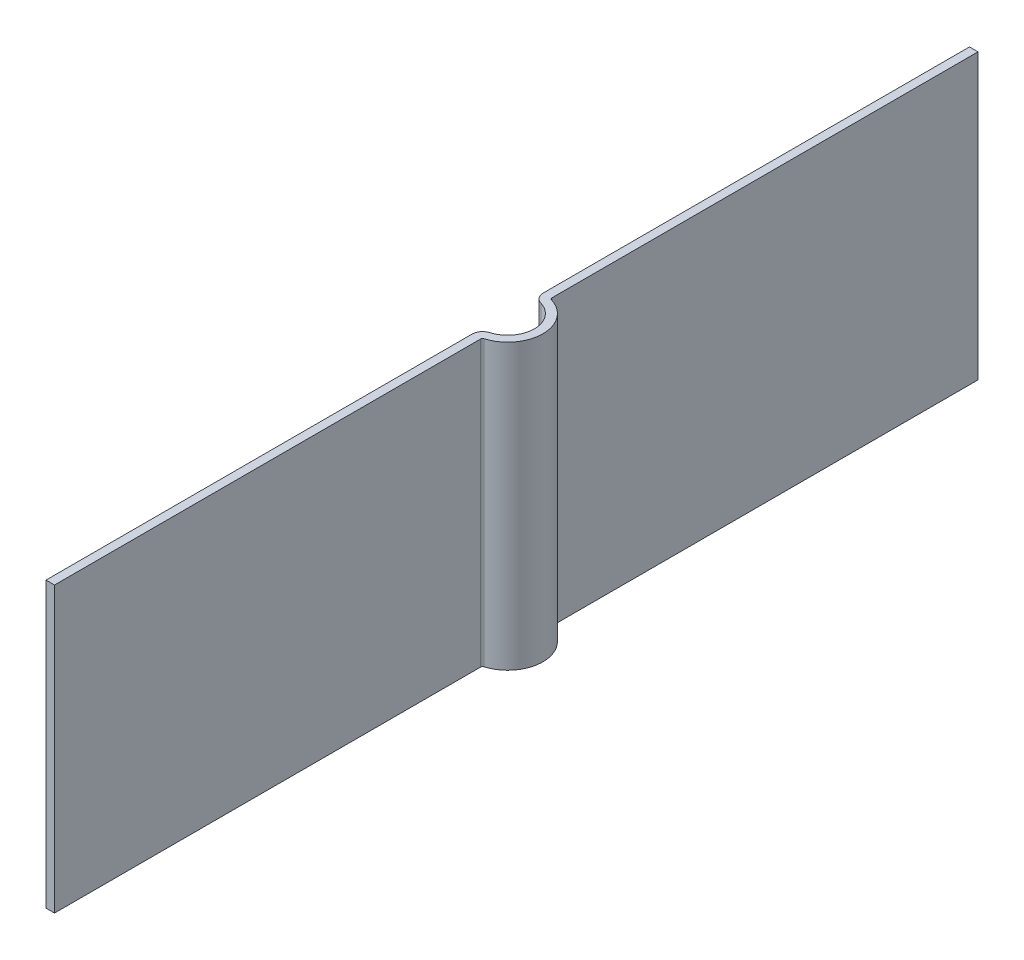
ISO-10303-21;
HEADER;
FILE_DESCRIPTION(('STEP AP214'),'2;1');
FILE_NAME('part.step','',(''),(''),'','','');
FILE_SCHEMA(('AUTOMOTIVE_DESIGN { 1 0 10303 214 1 1 1 1 }'));
ENDSEC;
DATA;
#1=APPLICATION_CONTEXT('core data for automotive mechanical design processes');
#2=APPLICATION_PROTOCOL_DEFINITION('international standard','automotive_design',2000,#1);
#3=PRODUCT_CONTEXT('',#1,'mechanical');
#4=PRODUCT('Part','Part','',(#3));
#5=PRODUCT_RELATED_PRODUCT_CATEGORY('part','',(#4));
#6=PRODUCT_DEFINITION_FORMATION('','',#4);
#7=PRODUCT_DEFINITION_CONTEXT('part definition',#1,'design');
#8=PRODUCT_DEFINITION('design','',#6,#7);
#9=PRODUCT_DEFINITION_SHAPE('','',#8);
#10=(LENGTH_UNIT() NAMED_UNIT(*) SI_UNIT(.MILLI.,.METRE.));
#11=(NAMED_UNIT(*) PLANE_ANGLE_UNIT() SI_UNIT($,.RADIAN.));
#12=(NAMED_UNIT(*) SI_UNIT($,.STERADIAN.) SOLID_ANGLE_UNIT());
#13=UNCERTAINTY_MEASURE_WITH_UNIT(LENGTH_MEASURE(1.E-05),#10,'distance_accuracy_value','');
#14=(GEOMETRIC_REPRESENTATION_CONTEXT(3) GLOBAL_UNCERTAINTY_ASSIGNED_CONTEXT((#13)) GLOBAL_UNIT_ASSIGNED_CONTEXT((#10,
#11,#12)) REPRESENTATION_CONTEXT('',''));
#15=CARTESIAN_POINT('',(0.,0.,0.));
#16=DIRECTION('',(0.,0.,1.));
#17=DIRECTION('',(1.,0.,0.));
#18=AXIS2_PLACEMENT_3D('',#15,#16,#17);
#19=CARTESIAN_POINT('',(0.,4.,0.503115294937453));
#20=DIRECTION('',(1.,0.,0.));
#21=DIRECTION('',(0.,0.,-1.));
#22=AXIS2_PLACEMENT_3D('',#19,#20,#21);
#23=PLANE('',#22);
#24=DIRECTION('',(0.,0.,1.));
#25=VECTOR('',#24,1.);
#26=CARTESIAN_POINT('',(0.,0.,0.503115294937453));
#27=LINE('',#26,#25);
#28=CARTESIAN_POINT('',(0.,0.,0.503115294937453));
#29=VERTEX_POINT('',#28);
#30=CARTESIAN_POINT('',(0.,0.,6.5));
#31=VERTEX_POINT('',#30);
#32=EDGE_CURVE('E154',#29,#31,#27,.T.);
#33=ORIENTED_EDGE('',*,*,#32,.T.);
#34=DIRECTION('',(0.,-1.,0.));
#35=VECTOR('',#34,1.);
#36=CARTESIAN_POINT('',(0.,4.,6.5));
#37=LINE('',#36,#35);
#38=CARTESIAN_POINT('',(0.,4.,6.5));
#39=VERTEX_POINT('',#38);
#40=EDGE_CURVE('E11',#39,#31,#37,.T.);
#41=ORIENTED_EDGE('',*,*,#40,.F.);
#42=DIRECTION('',(0.,0.,1.));
#43=VECTOR('',#42,1.);
#44=CARTESIAN_POINT('',(0.,4.,0.503115294937453));
#45=LINE('',#44,#43);
#46=CARTESIAN_POINT('',(0.,4.,0.503115294937453));
#47=VERTEX_POINT('',#46);
#48=EDGE_CURVE('E102',#47,#39,#45,.T.);
#49=ORIENTED_EDGE('',*,*,#48,.F.);
#50=DIRECTION('',(0.,-1.,0.));
#51=VECTOR('',#50,1.);
#52=CARTESIAN_POINT('',(0.,4.,0.503115294937453));
#53=LINE('',#52,#51);
#54=EDGE_CURVE('E150',#47,#29,#53,.T.);
#55=ORIENTED_EDGE('',*,*,#54,.T.);
#56=EDGE_LOOP('',(#33,#41,#49,#55));
#57=FACE_BOUND('',#56,.T.);
#58=ADVANCED_FACE('F34',(#57),#23,.F.);
#59=CARTESIAN_POINT('',(0.12,4.,6.5));
#60=DIRECTION('',(0.,0.,1.));
#61=DIRECTION('',(1.,0.,0.));
#62=AXIS2_PLACEMENT_3D('',#59,#60,#61);
#63=PLANE('',#62);
#64=DIRECTION('',(-1.,0.,0.));
#65=VECTOR('',#64,1.);
#66=CARTESIAN_POINT('',(0.12,0.,6.5));
#67=LINE('',#66,#65);
#68=CARTESIAN_POINT('',(0.12,0.,6.5));
#69=VERTEX_POINT('',#68);
#70=EDGE_CURVE('E157',#69,#31,#67,.T.);
#71=ORIENTED_EDGE('',*,*,#70,.F.);
#72=DIRECTION('',(0.,-1.,0.));
#73=VECTOR('',#72,1.);
#74=CARTESIAN_POINT('',(0.12,4.,6.5));
#75=LINE('',#74,#73);
#76=CARTESIAN_POINT('',(0.12,4.,6.5));
#77=VERTEX_POINT('',#76);
#78=EDGE_CURVE('E42',#77,#69,#75,.T.);
#79=ORIENTED_EDGE('',*,*,#78,.F.);
#80=DIRECTION('',(-1.,0.,0.));
#81=VECTOR('',#80,1.);
#82=CARTESIAN_POINT('',(0.12,4.,6.5));
#83=LINE('',#82,#81);
#84=EDGE_CURVE('E219',#77,#39,#83,.T.);
#85=ORIENTED_EDGE('',*,*,#84,.T.);
#86=ORIENTED_EDGE('',*,*,#40,.T.);
#87=EDGE_LOOP('',(#71,#79,#85,#86));
#88=FACE_BOUND('',#87,.T.);
#89=ADVANCED_FACE('F206',(#88),#63,.T.);
#90=CARTESIAN_POINT('',(0.12,4.,0.503115294937453));
#91=DIRECTION('',(1.,0.,0.));
#92=DIRECTION('',(0.,0.,-1.));
#93=AXIS2_PLACEMENT_3D('',#90,#91,#92);
#94=PLANE('',#93);
#95=DIRECTION('',(0.,0.,-1.));
#96=VECTOR('',#95,1.);
#97=CARTESIAN_POINT('',(0.12,0.,0.503115294937453));
#98=LINE('',#97,#96);
#99=CARTESIAN_POINT('',(0.12,0.,0.503115294937453));
#100=VERTEX_POINT('',#99);
#101=EDGE_CURVE('E160',#100,#69,#98,.F.);
#102=ORIENTED_EDGE('',*,*,#101,.F.);
#103=DIRECTION('',(0.,-1.,0.));
#104=VECTOR('',#103,1.);
#105=CARTESIAN_POINT('',(0.12,4.,0.503115294937453));
#106=LINE('',#105,#104);
#107=CARTESIAN_POINT('',(0.12,4.,0.503115294937453));
#108=VERTEX_POINT('',#107);
#109=EDGE_CURVE('E196',#108,#100,#106,.T.);
#110=ORIENTED_EDGE('',*,*,#109,.F.);
#111=DIRECTION('',(0.,0.,-1.));
#112=VECTOR('',#111,1.);
#113=CARTESIAN_POINT('',(0.12,4.,0.503115294937453));
#114=LINE('',#113,#112);
#115=EDGE_CURVE('E203',#108,#77,#114,.F.);
#116=ORIENTED_EDGE('',*,*,#115,.T.);
#117=ORIENTED_EDGE('',*,*,#78,.T.);
#118=EDGE_LOOP('',(#102,#110,#116,#117));
#119=FACE_BOUND('',#118,.T.);
#120=ADVANCED_FACE('F201',(#119),#94,.T.);
#121=CARTESIAN_POINT('',(0.15,4.,0.503115294937453));
#122=DIRECTION('',(0.,-1.,0.));
#123=DIRECTION('',(0.,0.,-1.));
#124=AXIS2_PLACEMENT_3D('',#121,#122,#123);
#125=CYLINDRICAL_SURFACE('',#124,0.03);
#126=CARTESIAN_POINT('',(0.15,0.,0.503115294937453));
#127=DIRECTION('',(0.,1.,0.));
#128=DIRECTION('',(1.,0.,0.));
#129=AXIS2_PLACEMENT_3D('',#126,#127,#128);
#130=CIRCLE('',#129,0.03);
#131=CARTESIAN_POINT('',(0.141428571428571,0.,0.474365849512455));
#132=VERTEX_POINT('',#131);
#133=EDGE_CURVE('E163',#132,#100,#130,.T.);
#134=ORIENTED_EDGE('',*,*,#133,.F.);
#135=DIRECTION('',(0.,-1.,0.));
#136=VECTOR('',#135,1.);
#137=CARTESIAN_POINT('',(0.141428571428571,4.,0.474365849512455));
#138=LINE('',#137,#136);
#139=CARTESIAN_POINT('',(0.141428571428571,4.,0.474365849512455));
#140=VERTEX_POINT('',#139);
#141=EDGE_CURVE('E194',#140,#132,#138,.T.);
#142=ORIENTED_EDGE('',*,*,#141,.F.);
#143=CARTESIAN_POINT('',(0.15,4.,0.503115294937453));
#144=DIRECTION('',(0.,1.,0.));
#145=DIRECTION('',(1.,0.,0.));
#146=AXIS2_PLACEMENT_3D('',#143,#144,#145);
#147=CIRCLE('',#146,0.03);
#148=EDGE_CURVE('E216',#140,#108,#147,.T.);
#149=ORIENTED_EDGE('',*,*,#148,.T.);
#150=ORIENTED_EDGE('',*,*,#109,.T.);
#151=EDGE_LOOP('',(#134,#142,#149,#150));
#152=FACE_BOUND('',#151,.T.);
#153=ADVANCED_FACE('F213',(#152),#125,.F.);
#154=CARTESIAN_POINT('',(0.,4.,0.));
#155=DIRECTION('',(0.,-1.,0.));
#156=DIRECTION('',(0.,0.,-1.));
#157=AXIS2_PLACEMENT_3D('',#154,#155,#156);
#158=CYLINDRICAL_SURFACE('',#157,0.495);
#159=CARTESIAN_POINT('',(0.,0.,0.));
#160=DIRECTION('',(0.,1.,0.));
#161=DIRECTION('',(1.,0.,0.));
#162=AXIS2_PLACEMENT_3D('',#159,#160,#161);
#163=CIRCLE('',#162,0.495);
#164=CARTESIAN_POINT('',(0.141428571428571,0.,-0.474365849512455));
#165=VERTEX_POINT('',#164);
#166=EDGE_CURVE('E166',#165,#132,#163,.F.);
#167=ORIENTED_EDGE('',*,*,#166,.F.);
#168=DIRECTION('',(0.,-1.,0.));
#169=VECTOR('',#168,1.);
#170=CARTESIAN_POINT('',(0.141428571428571,4.,-0.474365849512455));
#171=LINE('',#170,#169);
#172=CARTESIAN_POINT('',(0.141428571428571,4.,-0.474365849512455));
#173=VERTEX_POINT('',#172);
#174=EDGE_CURVE('E192',#173,#165,#171,.T.);
#175=ORIENTED_EDGE('',*,*,#174,.F.);
#176=CARTESIAN_POINT('',(0.,4.,0.));
#177=DIRECTION('',(0.,1.,0.));
#178=DIRECTION('',(1.,0.,0.));
#179=AXIS2_PLACEMENT_3D('',#176,#177,#178);
#180=CIRCLE('',#179,0.495);
#181=EDGE_CURVE('E221',#173,#140,#180,.F.);
#182=ORIENTED_EDGE('',*,*,#181,.T.);
#183=ORIENTED_EDGE('',*,*,#141,.T.);
#184=EDGE_LOOP('',(#167,#175,#182,#183));
#185=FACE_BOUND('',#184,.T.);
#186=ADVANCED_FACE('F323',(#185),#158,.T.);
#187=CARTESIAN_POINT('',(0.15,4.,-0.503115294937453));
#188=DIRECTION('',(0.,-1.,0.));
#189=DIRECTION('',(0.,0.,-1.));
#190=AXIS2_PLACEMENT_3D('',#187,#188,#189);
#191=CYLINDRICAL_SURFACE('',#190,0.03);
#192=CARTESIAN_POINT('',(0.15,0.,-0.503115294937453));
#193=DIRECTION('',(0.,1.,0.));
#194=DIRECTION('',(1.,0.,0.));
#195=AXIS2_PLACEMENT_3D('',#192,#193,#194);
#196=CIRCLE('',#195,0.03);
#197=CARTESIAN_POINT('',(0.12,0.,-0.503115294937453));
#198=VERTEX_POINT('',#197);
#199=EDGE_CURVE('E169',#198,#165,#196,.T.);
#200=ORIENTED_EDGE('',*,*,#199,.F.);
#201=DIRECTION('',(0.,-1.,0.));
#202=VECTOR('',#201,1.);
#203=CARTESIAN_POINT('',(0.12,4.,-0.503115294937453));
#204=LINE('',#203,#202);
#205=CARTESIAN_POINT('',(0.12,4.,-0.503115294937453));
#206=VERTEX_POINT('',#205);
#207=EDGE_CURVE('E190',#206,#198,#204,.T.);
#208=ORIENTED_EDGE('',*,*,#207,.F.);
#209=CARTESIAN_POINT('',(0.15,4.,-0.503115294937453));
#210=DIRECTION('',(0.,1.,0.));
#211=DIRECTION('',(1.,0.,0.));
#212=AXIS2_PLACEMENT_3D('',#209,#210,#211);
#213=CIRCLE('',#212,0.03);
#214=EDGE_CURVE('E227',#206,#173,#213,.T.);
#215=ORIENTED_EDGE('',*,*,#214,.T.);
#216=ORIENTED_EDGE('',*,*,#174,.T.);
#217=EDGE_LOOP('',(#200,#208,#215,#216));
#218=FACE_BOUND('',#217,.T.);
#219=ADVANCED_FACE('F313',(#218),#191,.F.);
#220=CARTESIAN_POINT('',(0.12,4.,-0.503115294937453));
#221=DIRECTION('',(1.,0.,0.));
#222=DIRECTION('',(0.,0.,-1.));
#223=AXIS2_PLACEMENT_3D('',#220,#221,#222);
#224=PLANE('',#223);
#225=DIRECTION('',(0.,0.,-1.));
#226=VECTOR('',#225,1.);
#227=CARTESIAN_POINT('',(0.12,0.,-0.503115294937453));
#228=LINE('',#227,#226);
#229=CARTESIAN_POINT('',(0.12,0.,-6.5));
#230=VERTEX_POINT('',#229);
#231=EDGE_CURVE('E172',#230,#198,#228,.F.);
#232=ORIENTED_EDGE('',*,*,#231,.F.);
#233=DIRECTION('',(0.,-1.,0.));
#234=VECTOR('',#233,1.);
#235=CARTESIAN_POINT('',(0.12,4.,-6.5));
#236=LINE('',#235,#234);
#237=CARTESIAN_POINT('',(0.12,4.,-6.5));
#238=VERTEX_POINT('',#237);
#239=EDGE_CURVE('E188',#238,#230,#236,.T.);
#240=ORIENTED_EDGE('',*,*,#239,.F.);
#241=DIRECTION('',(0.,0.,-1.));
#242=VECTOR('',#241,1.);
#243=CARTESIAN_POINT('',(0.12,4.,-0.503115294937453));
#244=LINE('',#243,#242);
#245=EDGE_CURVE('E230',#238,#206,#244,.F.);
#246=ORIENTED_EDGE('',*,*,#245,.T.);
#247=ORIENTED_EDGE('',*,*,#207,.T.);
#248=EDGE_LOOP('',(#232,#240,#246,#247));
#249=FACE_BOUND('',#248,.T.);
#250=ADVANCED_FACE('F242',(#249),#224,.T.);
#251=CARTESIAN_POINT('',(0.,4.,-6.5));
#252=DIRECTION('',(0.,0.,-1.));
#253=DIRECTION('',(-1.,0.,0.));
#254=AXIS2_PLACEMENT_3D('',#251,#252,#253);
#255=PLANE('',#254);
#256=DIRECTION('',(1.,0.,0.));
#257=VECTOR('',#256,1.);
#258=CARTESIAN_POINT('',(0.,0.,-6.5));
#259=LINE('',#258,#257);
#260=CARTESIAN_POINT('',(0.,0.,-6.5));
#261=VERTEX_POINT('',#260);
#262=EDGE_CURVE('E175',#261,#230,#259,.T.);
#263=ORIENTED_EDGE('',*,*,#262,.F.);
#264=DIRECTION('',(0.,-1.,0.));
#265=VECTOR('',#264,1.);
#266=CARTESIAN_POINT('',(0.,4.,-6.5));
#267=LINE('',#266,#265);
#268=CARTESIAN_POINT('',(0.,4.,-6.5));
#269=VERTEX_POINT('',#268);
#270=EDGE_CURVE('E186',#269,#261,#267,.T.);
#271=ORIENTED_EDGE('',*,*,#270,.F.);
#272=DIRECTION('',(1.,0.,0.));
#273=VECTOR('',#272,1.);
#274=CARTESIAN_POINT('',(0.,4.,-6.5));
#275=LINE('',#274,#273);
#276=EDGE_CURVE('E233',#269,#238,#275,.T.);
#277=ORIENTED_EDGE('',*,*,#276,.T.);
#278=ORIENTED_EDGE('',*,*,#239,.T.);
#279=EDGE_LOOP('',(#263,#271,#277,#278));
#280=FACE_BOUND('',#279,.T.);
#281=ADVANCED_FACE('F237',(#280),#255,.T.);
#282=CARTESIAN_POINT('',(0.,4.,-0.503115294937453));
#283=DIRECTION('',(1.,0.,0.));
#284=DIRECTION('',(0.,0.,-1.));
#285=AXIS2_PLACEMENT_3D('',#282,#283,#284);
#286=PLANE('',#285);
#287=DIRECTION('',(0.,0.,1.));
#288=VECTOR('',#287,1.);
#289=CARTESIAN_POINT('',(0.,0.,-0.503115294937453));
#290=LINE('',#289,#288);
#291=CARTESIAN_POINT('',(0.,0.,-0.503115294937453));
#292=VERTEX_POINT('',#291);
#293=EDGE_CURVE('E178',#261,#292,#290,.T.);
#294=ORIENTED_EDGE('',*,*,#293,.T.);
#295=DIRECTION('',(0.,-1.,0.));
#296=VECTOR('',#295,1.);
#297=CARTESIAN_POINT('',(0.,4.,-0.503115294937453));
#298=LINE('',#297,#296);
#299=CARTESIAN_POINT('',(0.,4.,-0.503115294937453));
#300=VERTEX_POINT('',#299);
#301=EDGE_CURVE('E145',#300,#292,#298,.T.);
#302=ORIENTED_EDGE('',*,*,#301,.F.);
#303=DIRECTION('',(0.,0.,1.));
#304=VECTOR('',#303,1.);
#305=CARTESIAN_POINT('',(0.,4.,-0.503115294937453));
#306=LINE('',#305,#304);
#307=EDGE_CURVE('E136',#269,#300,#306,.T.);
#308=ORIENTED_EDGE('',*,*,#307,.F.);
#309=ORIENTED_EDGE('',*,*,#270,.T.);
#310=EDGE_LOOP('',(#294,#302,#308,#309));
#311=FACE_BOUND('',#310,.T.);
#312=ADVANCED_FACE('F246',(#311),#286,.F.);
#313=CARTESIAN_POINT('',(0.15,4.,-0.503115294937453));
#314=DIRECTION('',(0.,-1.,0.));
#315=DIRECTION('',(0.,0.,-1.));
#316=AXIS2_PLACEMENT_3D('',#313,#314,#315);
#317=CYLINDRICAL_SURFACE('',#316,0.15);
#318=CARTESIAN_POINT('',(0.15,0.,-0.503115294937453));
#319=DIRECTION('',(0.,1.,0.));
#320=DIRECTION('',(0.,0.,1.));
#321=AXIS2_PLACEMENT_3D('',#318,#319,#320);
#322=CIRCLE('',#321,0.15);
#323=CARTESIAN_POINT('',(0.107142857142857,0.,-0.359368067812466));
#324=VERTEX_POINT('',#323);
#325=EDGE_CURVE('E144',#292,#324,#322,.T.);
#326=ORIENTED_EDGE('',*,*,#325,.T.);
#327=DIRECTION('',(0.,-1.,0.));
#328=VECTOR('',#327,1.);
#329=CARTESIAN_POINT('',(0.107142857142857,4.,-0.359368067812466));
#330=LINE('',#329,#328);
#331=CARTESIAN_POINT('',(0.107142857142857,4.,-0.359368067812466));
#332=VERTEX_POINT('',#331);
#333=EDGE_CURVE('E141',#332,#324,#330,.T.);
#334=ORIENTED_EDGE('',*,*,#333,.F.);
#335=CARTESIAN_POINT('',(0.15,4.,-0.503115294937453));
#336=DIRECTION('',(0.,1.,0.));
#337=DIRECTION('',(0.,0.,1.));
#338=AXIS2_PLACEMENT_3D('',#335,#336,#337);
#339=CIRCLE('',#338,0.15);
#340=EDGE_CURVE('E129',#300,#332,#339,.T.);
#341=ORIENTED_EDGE('',*,*,#340,.F.);
#342=ORIENTED_EDGE('',*,*,#301,.T.);
#343=EDGE_LOOP('',(#326,#334,#341,#342));
#344=FACE_BOUND('',#343,.T.);
#345=ADVANCED_FACE('F142',(#344),#317,.T.);
#346=CARTESIAN_POINT('',(0.,4.,0.));
#347=DIRECTION('',(0.,-1.,0.));
#348=DIRECTION('',(0.,0.,-1.));
#349=AXIS2_PLACEMENT_3D('',#346,#347,#348);
#350=CYLINDRICAL_SURFACE('',#349,0.375);
#351=CARTESIAN_POINT('',(0.,0.,0.));
#352=DIRECTION('',(0.,-1.,0.));
#353=DIRECTION('',(0.,0.,1.));
#354=AXIS2_PLACEMENT_3D('',#351,#352,#353);
#355=CIRCLE('',#354,0.375);
#356=CARTESIAN_POINT('',(0.107142857142857,0.,0.359368067812466));
#357=VERTEX_POINT('',#356);
#358=EDGE_CURVE('E90',#324,#357,#355,.T.);
#359=ORIENTED_EDGE('',*,*,#358,.T.);
#360=DIRECTION('',(0.,-1.,0.));
#361=VECTOR('',#360,1.);
#362=CARTESIAN_POINT('',(0.107142857142857,4.,0.359368067812466));
#363=LINE('',#362,#361);
#364=CARTESIAN_POINT('',(0.107142857142857,4.,0.359368067812466));
#365=VERTEX_POINT('',#364);
#366=EDGE_CURVE('E146',#365,#357,#363,.T.);
#367=ORIENTED_EDGE('',*,*,#366,.F.);
#368=CARTESIAN_POINT('',(0.,4.,0.));
#369=DIRECTION('',(0.,-1.,0.));
#370=DIRECTION('',(0.,0.,1.));
#371=AXIS2_PLACEMENT_3D('',#368,#369,#370);
#372=CIRCLE('',#371,0.375);
#373=EDGE_CURVE('E133',#332,#365,#372,.T.);
#374=ORIENTED_EDGE('',*,*,#373,.F.);
#375=ORIENTED_EDGE('',*,*,#333,.T.);
#376=EDGE_LOOP('',(#359,#367,#374,#375));
#377=FACE_BOUND('',#376,.T.);
#378=ADVANCED_FACE('F148',(#377),#350,.F.);
#379=CARTESIAN_POINT('',(0.15,4.,0.503115294937453));
#380=DIRECTION('',(0.,-1.,0.));
#381=DIRECTION('',(0.,0.,-1.));
#382=AXIS2_PLACEMENT_3D('',#379,#380,#381);
#383=CYLINDRICAL_SURFACE('',#382,0.15);
#384=CARTESIAN_POINT('',(0.15,0.,0.503115294937453));
#385=DIRECTION('',(0.,1.,0.));
#386=DIRECTION('',(0.,0.,-1.));
#387=AXIS2_PLACEMENT_3D('',#384,#385,#386);
#388=CIRCLE('',#387,0.15);
#389=EDGE_CURVE('E96',#357,#29,#388,.T.);
#390=ORIENTED_EDGE('',*,*,#389,.T.);
#391=ORIENTED_EDGE('',*,*,#54,.F.);
#392=CARTESIAN_POINT('',(0.15,4.,0.503115294937453));
#393=DIRECTION('',(0.,1.,0.));
#394=DIRECTION('',(0.,0.,-1.));
#395=AXIS2_PLACEMENT_3D('',#392,#393,#394);
#396=CIRCLE('',#395,0.15);
#397=EDGE_CURVE('E50',#365,#47,#396,.T.);
#398=ORIENTED_EDGE('',*,*,#397,.F.);
#399=ORIENTED_EDGE('',*,*,#366,.T.);
#400=EDGE_LOOP('',(#390,#391,#398,#399));
#401=FACE_BOUND('',#400,.T.);
#402=ADVANCED_FACE('F260',(#401),#383,.T.);
#403=CARTESIAN_POINT('',(0.15,4.,0.503115294937453));
#404=DIRECTION('',(0.,1.,0.));
#405=DIRECTION('',(0.,0.,1.));
#406=AXIS2_PLACEMENT_3D('',#403,#404,#405);
#407=PLANE('',#406);
#408=ORIENTED_EDGE('',*,*,#48,.T.);
#409=ORIENTED_EDGE('',*,*,#84,.F.);
#410=ORIENTED_EDGE('',*,*,#115,.F.);
#411=ORIENTED_EDGE('',*,*,#148,.F.);
#412=ORIENTED_EDGE('',*,*,#181,.F.);
#413=ORIENTED_EDGE('',*,*,#214,.F.);
#414=ORIENTED_EDGE('',*,*,#245,.F.);
#415=ORIENTED_EDGE('',*,*,#276,.F.);
#416=ORIENTED_EDGE('',*,*,#307,.T.);
#417=ORIENTED_EDGE('',*,*,#340,.T.);
#418=ORIENTED_EDGE('',*,*,#373,.T.);
#419=ORIENTED_EDGE('',*,*,#397,.T.);
#420=EDGE_LOOP('',(#408,#409,#410,#411,#412,#413,#414,#415,#416,#417,#418,#419));
#421=FACE_BOUND('',#420,.T.);
#422=ADVANCED_FACE('F131',(#421),#407,.T.);
#423=CARTESIAN_POINT('',(0.15,0.,0.503115294937453));
#424=DIRECTION('',(0.,1.,0.));
#425=DIRECTION('',(0.,0.,1.));
#426=AXIS2_PLACEMENT_3D('',#423,#424,#425);
#427=PLANE('',#426);
#428=ORIENTED_EDGE('',*,*,#32,.F.);
#429=ORIENTED_EDGE('',*,*,#389,.F.);
#430=ORIENTED_EDGE('',*,*,#358,.F.);
#431=ORIENTED_EDGE('',*,*,#325,.F.);
#432=ORIENTED_EDGE('',*,*,#293,.F.);
#433=ORIENTED_EDGE('',*,*,#262,.T.);
#434=ORIENTED_EDGE('',*,*,#231,.T.);
#435=ORIENTED_EDGE('',*,*,#199,.T.);
#436=ORIENTED_EDGE('',*,*,#166,.T.);
#437=ORIENTED_EDGE('',*,*,#133,.T.);
#438=ORIENTED_EDGE('',*,*,#101,.T.);
#439=ORIENTED_EDGE('',*,*,#70,.T.);
#440=EDGE_LOOP('',(#428,#429,#430,#431,#432,#433,#434,#435,#436,#437,#438,#439));
#441=FACE_BOUND('',#440,.T.);
#442=ADVANCED_FACE('F209',(#441),#427,.F.);
#443=CLOSED_SHELL('',(#58,#89,#120,#153,#186,#219,#250,#281,#312,#345,#378,#402,#422,#442));
#444=MANIFOLD_SOLID_BREP('B2',#443);
#445=ADVANCED_BREP_SHAPE_REPRESENTATION('',(#18,#444),#14);
#446=SHAPE_DEFINITION_REPRESENTATION(#9,#445);
ENDSEC;
END-ISO-10303-21;
